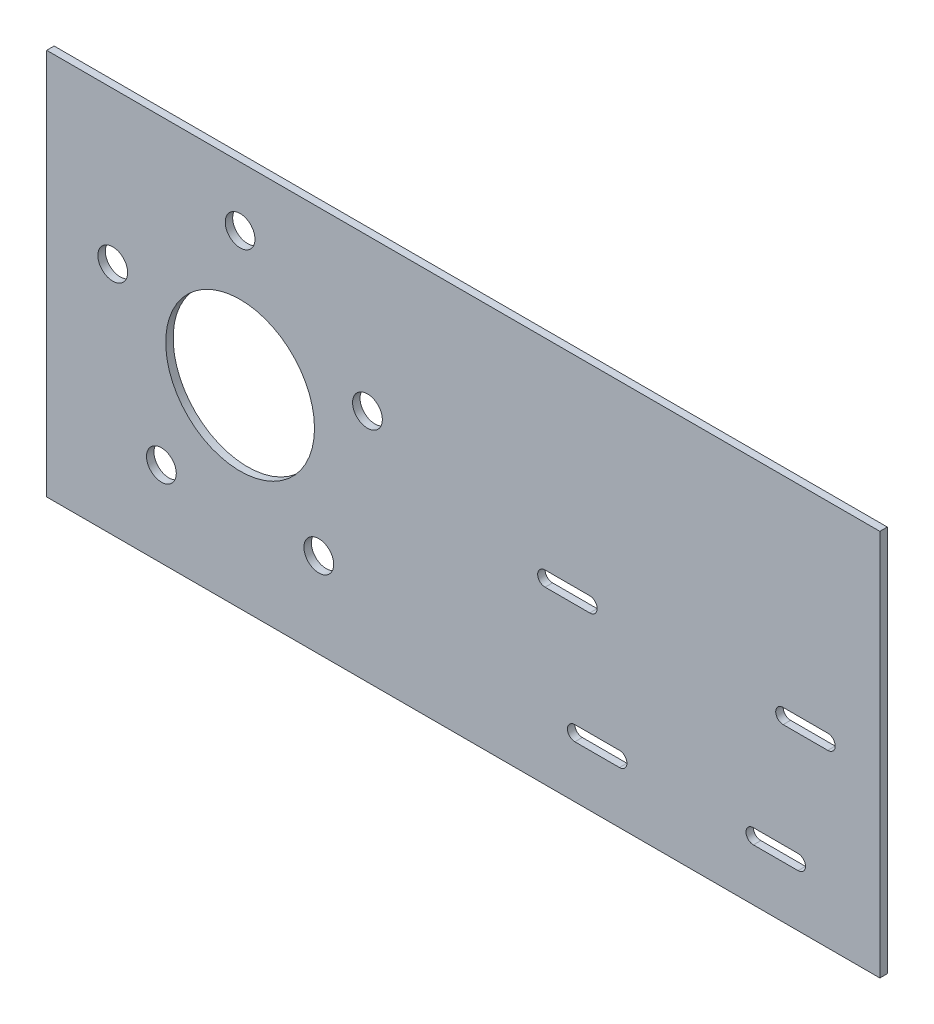
ISO-10303-21;
HEADER;
FILE_DESCRIPTION(('STEP AP214'),'2;1');
FILE_NAME('part.step','',(''),(''),'','','');
FILE_SCHEMA(('AUTOMOTIVE_DESIGN { 1 0 10303 214 1 1 1 1 }'));
ENDSEC;
DATA;
#1=APPLICATION_CONTEXT('core data for automotive mechanical design processes');
#2=APPLICATION_PROTOCOL_DEFINITION('international standard','automotive_design',2000,#1);
#3=PRODUCT_CONTEXT('',#1,'mechanical');
#4=PRODUCT('Part','Part','',(#3));
#5=PRODUCT_RELATED_PRODUCT_CATEGORY('part','',(#4));
#6=PRODUCT_DEFINITION_FORMATION('','',#4);
#7=PRODUCT_DEFINITION_CONTEXT('part definition',#1,'design');
#8=PRODUCT_DEFINITION('design','',#6,#7);
#9=PRODUCT_DEFINITION_SHAPE('','',#8);
#10=(LENGTH_UNIT() NAMED_UNIT(*) SI_UNIT(.MILLI.,.METRE.));
#11=(NAMED_UNIT(*) PLANE_ANGLE_UNIT() SI_UNIT($,.RADIAN.));
#12=(NAMED_UNIT(*) SI_UNIT($,.STERADIAN.) SOLID_ANGLE_UNIT());
#13=UNCERTAINTY_MEASURE_WITH_UNIT(LENGTH_MEASURE(1.E-05),#10,'distance_accuracy_value','');
#14=(GEOMETRIC_REPRESENTATION_CONTEXT(3) GLOBAL_UNCERTAINTY_ASSIGNED_CONTEXT((#13)) GLOBAL_UNIT_ASSIGNED_CONTEXT((#10,
#11,#12)) REPRESENTATION_CONTEXT('',''));
#15=CARTESIAN_POINT('',(0.,0.,0.));
#16=DIRECTION('',(0.,0.,1.));
#17=DIRECTION('',(1.,0.,0.));
#18=AXIS2_PLACEMENT_3D('',#15,#16,#17);
#19=CARTESIAN_POINT('',(-54.3528799062678,17.6603212285289,3.175));
#20=DIRECTION('',(0.,0.,-1.));
#21=DIRECTION('',(-0.309016994374958,-0.95105651629515,0.));
#22=AXIS2_PLACEMENT_3D('',#19,#20,#21);
#23=CYLINDRICAL_SURFACE('',#22,6.35);
#24=CARTESIAN_POINT('',(-54.3528799062678,17.6603212285289,3.175));
#25=DIRECTION('',(0.,0.,1.));
#26=DIRECTION('',(0.309016994374958,0.95105651629515,0.));
#27=AXIS2_PLACEMENT_3D('',#24,#25,#26);
#28=CIRCLE('',#27,6.35);
#29=CARTESIAN_POINT('',(-52.3906219919868,23.6995301070031,3.175));
#30=VERTEX_POINT('',#29);
#31=EDGE_CURVE('E44',#30,#30,#28,.T.);
#32=ORIENTED_EDGE('',*,*,#31,.T.);
#33=EDGE_LOOP('',(#32));
#34=FACE_BOUND('',#33,.T.);
#35=CARTESIAN_POINT('',(-54.3528799062678,17.6603212285289,0.));
#36=DIRECTION('',(0.,0.,1.));
#37=DIRECTION('',(0.309016994374958,0.95105651629515,0.));
#38=AXIS2_PLACEMENT_3D('',#35,#36,#37);
#39=CIRCLE('',#38,6.35);
#40=CARTESIAN_POINT('',(-52.3906219919868,23.6995301070031,0.));
#41=VERTEX_POINT('',#40);
#42=EDGE_CURVE('E11',#41,#41,#39,.T.);
#43=ORIENTED_EDGE('',*,*,#42,.F.);
#44=EDGE_LOOP('',(#43));
#45=FACE_BOUND('',#44,.T.);
#46=ADVANCED_FACE('F37',(#34,#45),#23,.F.);
#47=CARTESIAN_POINT('',(-33.5919271685152,-46.235321228528,3.175));
#48=DIRECTION('',(0.,0.,-1.));
#49=DIRECTION('',(0.809016994374942,-0.58778525229248,0.));
#50=AXIS2_PLACEMENT_3D('',#47,#48,#49);
#51=CYLINDRICAL_SURFACE('',#50,6.35);
#52=CARTESIAN_POINT('',(-33.5919271685152,-46.235321228528,3.175));
#53=DIRECTION('',(0.,0.,1.));
#54=DIRECTION('',(-0.809016994374942,0.58778525229248,0.));
#55=AXIS2_PLACEMENT_3D('',#52,#53,#54);
#56=CIRCLE('',#55,6.35);
#57=CARTESIAN_POINT('',(-38.7291850827961,-42.5028848764707,3.175));
#58=VERTEX_POINT('',#57);
#59=EDGE_CURVE('E361',#58,#58,#56,.T.);
#60=ORIENTED_EDGE('',*,*,#59,.T.);
#61=EDGE_LOOP('',(#60));
#62=FACE_BOUND('',#61,.T.);
#63=CARTESIAN_POINT('',(-33.5919271685152,-46.235321228528,0.));
#64=DIRECTION('',(0.,0.,1.));
#65=DIRECTION('',(-0.809016994374942,0.58778525229248,0.));
#66=AXIS2_PLACEMENT_3D('',#63,#64,#65);
#67=CIRCLE('',#66,6.35);
#68=CARTESIAN_POINT('',(-38.7291850827961,-42.5028848764707,0.));
#69=VERTEX_POINT('',#68);
#70=EDGE_CURVE('E364',#69,#69,#67,.T.);
#71=ORIENTED_EDGE('',*,*,#70,.F.);
#72=EDGE_LOOP('',(#71));
#73=FACE_BOUND('',#72,.T.);
#74=ADVANCED_FACE('F424',(#62,#73),#51,.F.);
#75=CARTESIAN_POINT('',(33.5919271685146,-46.2353212285284,3.175));
#76=DIRECTION('',(0.,0.,-1.));
#77=DIRECTION('',(0.809016994374951,0.587785252292469,0.));
#78=AXIS2_PLACEMENT_3D('',#75,#76,#77);
#79=CYLINDRICAL_SURFACE('',#78,6.35);
#80=CARTESIAN_POINT('',(33.5919271685146,-46.2353212285284,3.175));
#81=DIRECTION('',(0.,0.,1.));
#82=DIRECTION('',(-0.809016994374951,-0.587785252292469,0.));
#83=AXIS2_PLACEMENT_3D('',#80,#81,#82);
#84=CIRCLE('',#83,6.35);
#85=CARTESIAN_POINT('',(28.4546692542336,-49.9677575805856,3.175));
#86=VERTEX_POINT('',#85);
#87=EDGE_CURVE('E355',#86,#86,#84,.T.);
#88=ORIENTED_EDGE('',*,*,#87,.T.);
#89=EDGE_LOOP('',(#88));
#90=FACE_BOUND('',#89,.T.);
#91=CARTESIAN_POINT('',(33.5919271685146,-46.2353212285284,0.));
#92=DIRECTION('',(0.,0.,1.));
#93=DIRECTION('',(-0.809016994374951,-0.587785252292469,0.));
#94=AXIS2_PLACEMENT_3D('',#91,#92,#93);
#95=CIRCLE('',#94,6.35);
#96=CARTESIAN_POINT('',(28.4546692542336,-49.9677575805856,0.));
#97=VERTEX_POINT('',#96);
#98=EDGE_CURVE('E358',#97,#97,#95,.T.);
#99=ORIENTED_EDGE('',*,*,#98,.F.);
#100=EDGE_LOOP('',(#99));
#101=FACE_BOUND('',#100,.T.);
#102=ADVANCED_FACE('F428',(#90,#101),#79,.F.);
#103=CARTESIAN_POINT('',(54.3528799062681,17.6603212285281,3.175));
#104=DIRECTION('',(0.,0.,-1.));
#105=DIRECTION('',(-0.309016994374945,0.951056516295155,0.));
#106=AXIS2_PLACEMENT_3D('',#103,#104,#105);
#107=CYLINDRICAL_SURFACE('',#106,6.35);
#108=CARTESIAN_POINT('',(54.3528799062681,17.6603212285281,3.175));
#109=DIRECTION('',(0.,0.,1.));
#110=DIRECTION('',(0.309016994374945,-0.951056516295155,0.));
#111=AXIS2_PLACEMENT_3D('',#108,#109,#110);
#112=CIRCLE('',#111,6.35);
#113=CARTESIAN_POINT('',(56.315137820549,11.6211123500539,3.175));
#114=VERTEX_POINT('',#113);
#115=EDGE_CURVE('E349',#114,#114,#112,.T.);
#116=ORIENTED_EDGE('',*,*,#115,.T.);
#117=EDGE_LOOP('',(#116));
#118=FACE_BOUND('',#117,.T.);
#119=CARTESIAN_POINT('',(54.3528799062681,17.6603212285281,0.));
#120=DIRECTION('',(0.,0.,1.));
#121=DIRECTION('',(0.309016994374945,-0.951056516295155,0.));
#122=AXIS2_PLACEMENT_3D('',#119,#120,#121);
#123=CIRCLE('',#122,6.35);
#124=CARTESIAN_POINT('',(56.315137820549,11.6211123500539,0.));
#125=VERTEX_POINT('',#124);
#126=EDGE_CURVE('E352',#125,#125,#123,.T.);
#127=ORIENTED_EDGE('',*,*,#126,.F.);
#128=EDGE_LOOP('',(#127));
#129=FACE_BOUND('',#128,.T.);
#130=ADVANCED_FACE('F374',(#118,#129),#107,.F.);
#131=CARTESIAN_POINT('',(-82.55,82.5499999999999,3.175));
#132=DIRECTION('',(0.,0.,1.));
#133=DIRECTION('',(1.,0.,0.));
#134=AXIS2_PLACEMENT_3D('',#131,#132,#133);
#135=PLANE('',#134);
#136=ORIENTED_EDGE('',*,*,#31,.F.);
#137=EDGE_LOOP('',(#136));
#138=FACE_BOUND('',#137,.T.);
#139=ORIENTED_EDGE('',*,*,#59,.F.);
#140=EDGE_LOOP('',(#139));
#141=FACE_BOUND('',#140,.T.);
#142=ORIENTED_EDGE('',*,*,#87,.F.);
#143=EDGE_LOOP('',(#142));
#144=FACE_BOUND('',#143,.T.);
#145=ORIENTED_EDGE('',*,*,#115,.F.);
#146=EDGE_LOOP('',(#145));
#147=FACE_BOUND('',#146,.T.);
#148=CARTESIAN_POINT('',(142.875,-57.15,3.175));
#149=DIRECTION('',(0.,0.,1.));
#150=DIRECTION('',(1.,0.,0.));
#151=AXIS2_PLACEMENT_3D('',#148,#149,#150);
#152=CIRCLE('',#151,3.17500000000001);
#153=CARTESIAN_POINT('',(142.875,-53.975,3.175));
#154=VERTEX_POINT('',#153);
#155=CARTESIAN_POINT('',(142.875,-60.325,3.175));
#156=VERTEX_POINT('',#155);
#157=EDGE_CURVE('E51',#154,#156,#152,.T.);
#158=ORIENTED_EDGE('',*,*,#157,.F.);
#159=DIRECTION('',(-1.,0.,0.));
#160=VECTOR('',#159,1.);
#161=CARTESIAN_POINT('',(142.875,-53.975,3.175));
#162=LINE('',#161,#160);
#163=CARTESIAN_POINT('',(161.925,-53.9749999999999,3.175));
#164=VERTEX_POINT('',#163);
#165=EDGE_CURVE('E191',#164,#154,#162,.T.);
#166=ORIENTED_EDGE('',*,*,#165,.F.);
#167=CARTESIAN_POINT('',(161.925,-57.15,3.175));
#168=DIRECTION('',(0.,0.,1.));
#169=DIRECTION('',(1.,0.,0.));
#170=AXIS2_PLACEMENT_3D('',#167,#168,#169);
#171=CIRCLE('',#170,3.17500000000001);
#172=CARTESIAN_POINT('',(161.925,-60.325,3.175));
#173=VERTEX_POINT('',#172);
#174=EDGE_CURVE('E194',#173,#164,#171,.T.);
#175=ORIENTED_EDGE('',*,*,#174,.F.);
#176=DIRECTION('',(1.,0.,0.));
#177=VECTOR('',#176,1.);
#178=CARTESIAN_POINT('',(142.875,-60.325,3.175));
#179=LINE('',#178,#177);
#180=EDGE_CURVE('E200',#156,#173,#179,.T.);
#181=ORIENTED_EDGE('',*,*,#180,.F.);
#182=EDGE_LOOP('',(#158,#166,#175,#181));
#183=FACE_BOUND('',#182,.T.);
#184=CARTESIAN_POINT('',(238.125,-57.15,3.175));
#185=DIRECTION('',(0.,0.,1.));
#186=DIRECTION('',(1.,0.,0.));
#187=AXIS2_PLACEMENT_3D('',#184,#185,#186);
#188=CIRCLE('',#187,3.17499999999999);
#189=CARTESIAN_POINT('',(238.125,-60.3249999999999,3.175));
#190=VERTEX_POINT('',#189);
#191=CARTESIAN_POINT('',(238.125,-53.975,3.175));
#192=VERTEX_POINT('',#191);
#193=EDGE_CURVE('E206',#190,#192,#188,.T.);
#194=ORIENTED_EDGE('',*,*,#193,.F.);
#195=DIRECTION('',(1.,0.,0.));
#196=VECTOR('',#195,1.);
#197=CARTESIAN_POINT('',(238.125,-60.3249999999999,3.175));
#198=LINE('',#197,#196);
#199=CARTESIAN_POINT('',(219.075,-60.325,3.175));
#200=VERTEX_POINT('',#199);
#201=EDGE_CURVE('E214',#200,#190,#198,.T.);
#202=ORIENTED_EDGE('',*,*,#201,.F.);
#203=CARTESIAN_POINT('',(219.075,-57.15,3.175));
#204=DIRECTION('',(0.,0.,1.));
#205=DIRECTION('',(1.,0.,0.));
#206=AXIS2_PLACEMENT_3D('',#203,#204,#205);
#207=CIRCLE('',#206,3.17499999999999);
#208=CARTESIAN_POINT('',(219.075,-53.975,3.175));
#209=VERTEX_POINT('',#208);
#210=EDGE_CURVE('E228',#209,#200,#207,.T.);
#211=ORIENTED_EDGE('',*,*,#210,.F.);
#212=DIRECTION('',(-1.,0.,0.));
#213=VECTOR('',#212,1.);
#214=CARTESIAN_POINT('',(238.125,-53.975,3.175));
#215=LINE('',#214,#213);
#216=EDGE_CURVE('E225',#192,#209,#215,.T.);
#217=ORIENTED_EDGE('',*,*,#216,.F.);
#218=EDGE_LOOP('',(#194,#202,#211,#217));
#219=FACE_BOUND('',#218,.T.);
#220=CARTESIAN_POINT('',(250.825,-6.34999999999996,3.175));
#221=DIRECTION('',(0.,0.,1.));
#222=DIRECTION('',(1.,0.,0.));
#223=AXIS2_PLACEMENT_3D('',#220,#221,#222);
#224=CIRCLE('',#223,3.175);
#225=CARTESIAN_POINT('',(250.825,-9.52499999999996,3.175));
#226=VERTEX_POINT('',#225);
#227=CARTESIAN_POINT('',(250.825,-3.17499999999997,3.175));
#228=VERTEX_POINT('',#227);
#229=EDGE_CURVE('E235',#226,#228,#224,.T.);
#230=ORIENTED_EDGE('',*,*,#229,.F.);
#231=DIRECTION('',(1.,0.,0.));
#232=VECTOR('',#231,1.);
#233=CARTESIAN_POINT('',(250.825,-9.52499999999996,3.175));
#234=LINE('',#233,#232);
#235=CARTESIAN_POINT('',(231.775,-9.52499999999997,3.175));
#236=VERTEX_POINT('',#235);
#237=EDGE_CURVE('E246',#236,#226,#234,.T.);
#238=ORIENTED_EDGE('',*,*,#237,.F.);
#239=CARTESIAN_POINT('',(231.775,-6.34999999999997,3.175));
#240=DIRECTION('',(0.,0.,1.));
#241=DIRECTION('',(1.,0.,0.));
#242=AXIS2_PLACEMENT_3D('',#239,#240,#241);
#243=CIRCLE('',#242,3.175);
#244=CARTESIAN_POINT('',(231.775,-3.17499999999997,3.175));
#245=VERTEX_POINT('',#244);
#246=EDGE_CURVE('E260',#245,#236,#243,.T.);
#247=ORIENTED_EDGE('',*,*,#246,.F.);
#248=DIRECTION('',(-1.,0.,0.));
#249=VECTOR('',#248,1.);
#250=CARTESIAN_POINT('',(250.825,-3.17499999999996,3.175));
#251=LINE('',#250,#249);
#252=EDGE_CURVE('E257',#228,#245,#251,.T.);
#253=ORIENTED_EDGE('',*,*,#252,.F.);
#254=EDGE_LOOP('',(#230,#238,#247,#253));
#255=FACE_BOUND('',#254,.T.);
#256=CARTESIAN_POINT('',(149.225,-6.34999999999996,3.175));
#257=DIRECTION('',(0.,0.,1.));
#258=DIRECTION('',(1.,0.,0.));
#259=AXIS2_PLACEMENT_3D('',#256,#257,#258);
#260=CIRCLE('',#259,3.175);
#261=CARTESIAN_POINT('',(149.225,-9.52499999999997,3.175));
#262=VERTEX_POINT('',#261);
#263=CARTESIAN_POINT('',(149.225,-3.17499999999995,3.175));
#264=VERTEX_POINT('',#263);
#265=EDGE_CURVE('E267',#262,#264,#260,.T.);
#266=ORIENTED_EDGE('',*,*,#265,.F.);
#267=DIRECTION('',(1.,0.,0.));
#268=VECTOR('',#267,1.);
#269=CARTESIAN_POINT('',(149.225,-9.52499999999997,3.175));
#270=LINE('',#269,#268);
#271=CARTESIAN_POINT('',(130.175,-9.52499999999997,3.175));
#272=VERTEX_POINT('',#271);
#273=EDGE_CURVE('E278',#272,#262,#270,.T.);
#274=ORIENTED_EDGE('',*,*,#273,.F.);
#275=CARTESIAN_POINT('',(130.175,-6.34999999999997,3.175));
#276=DIRECTION('',(0.,0.,1.));
#277=DIRECTION('',(1.,0.,0.));
#278=AXIS2_PLACEMENT_3D('',#275,#276,#277);
#279=CIRCLE('',#278,3.175);
#280=CARTESIAN_POINT('',(130.175,-3.17499999999997,3.175));
#281=VERTEX_POINT('',#280);
#282=EDGE_CURVE('E292',#281,#272,#279,.T.);
#283=ORIENTED_EDGE('',*,*,#282,.F.);
#284=DIRECTION('',(-1.,0.,0.));
#285=VECTOR('',#284,1.);
#286=CARTESIAN_POINT('',(149.225,-3.17499999999996,3.175));
#287=LINE('',#286,#285);
#288=EDGE_CURVE('E289',#264,#281,#287,.T.);
#289=ORIENTED_EDGE('',*,*,#288,.F.);
#290=EDGE_LOOP('',(#266,#274,#283,#289));
#291=FACE_BOUND('',#290,.T.);
#292=CARTESIAN_POINT('',(0.,0.,3.175));
#293=DIRECTION('',(0.,0.,1.));
#294=DIRECTION('',(1.,0.,0.));
#295=AXIS2_PLACEMENT_3D('',#292,#293,#294);
#296=CIRCLE('',#295,31.75);
#297=CARTESIAN_POINT('',(31.75,0.,3.175));
#298=VERTEX_POINT('',#297);
#299=EDGE_CURVE('E312',#298,#298,#296,.T.);
#300=ORIENTED_EDGE('',*,*,#299,.F.);
#301=EDGE_LOOP('',(#300));
#302=FACE_BOUND('',#301,.T.);
#303=DIRECTION('',(0.,-1.,0.));
#304=VECTOR('',#303,1.);
#305=CARTESIAN_POINT('',(-82.55,-82.5500000000001,3.175));
#306=LINE('',#305,#304);
#307=CARTESIAN_POINT('',(-82.55,82.5499999999999,3.175));
#308=VERTEX_POINT('',#307);
#309=CARTESIAN_POINT('',(-82.55,-82.5500000000001,3.175));
#310=VERTEX_POINT('',#309);
#311=EDGE_CURVE('E320',#308,#310,#306,.T.);
#312=ORIENTED_EDGE('',*,*,#311,.T.);
#313=DIRECTION('',(1.,0.,0.));
#314=VECTOR('',#313,1.);
#315=CARTESIAN_POINT('',(273.05,-82.5499999999999,3.175));
#316=LINE('',#315,#314);
#317=CARTESIAN_POINT('',(273.05,-82.5499999999999,3.175));
#318=VERTEX_POINT('',#317);
#319=EDGE_CURVE('E323',#310,#318,#316,.T.);
#320=ORIENTED_EDGE('',*,*,#319,.T.);
#321=DIRECTION('',(0.,1.,0.));
#322=VECTOR('',#321,1.);
#323=CARTESIAN_POINT('',(273.05,-82.5499999999999,3.175));
#324=LINE('',#323,#322);
#325=CARTESIAN_POINT('',(273.05,82.5500000000001,3.175));
#326=VERTEX_POINT('',#325);
#327=EDGE_CURVE('E326',#318,#326,#324,.T.);
#328=ORIENTED_EDGE('',*,*,#327,.T.);
#329=DIRECTION('',(-1.,0.,0.));
#330=VECTOR('',#329,1.);
#331=CARTESIAN_POINT('',(273.05,82.5500000000001,3.175));
#332=LINE('',#331,#330);
#333=EDGE_CURVE('E328',#326,#308,#332,.T.);
#334=ORIENTED_EDGE('',*,*,#333,.T.);
#335=EDGE_LOOP('',(#312,#320,#328,#334));
#336=FACE_BOUND('',#335,.T.);
#337=CARTESIAN_POINT('',(0.,57.15,3.175));
#338=DIRECTION('',(0.,0.,1.));
#339=DIRECTION('',(1.,0.,0.));
#340=AXIS2_PLACEMENT_3D('',#337,#338,#339);
#341=CIRCLE('',#340,6.35);
#342=CARTESIAN_POINT('',(6.35,57.15,3.175));
#343=VERTEX_POINT('',#342);
#344=EDGE_CURVE('E306',#343,#343,#341,.T.);
#345=ORIENTED_EDGE('',*,*,#344,.F.);
#346=EDGE_LOOP('',(#345));
#347=FACE_BOUND('',#346,.T.);
#348=ADVANCED_FACE('F371',(#138,#141,#144,#147,#183,#219,#255,#291,#302,#336,#347),#135,.T.);
#349=CARTESIAN_POINT('',(-82.55,82.5499999999999,0.));
#350=DIRECTION('',(0.,0.,1.));
#351=DIRECTION('',(1.,0.,0.));
#352=AXIS2_PLACEMENT_3D('',#349,#350,#351);
#353=PLANE('',#352);
#354=ORIENTED_EDGE('',*,*,#42,.T.);
#355=EDGE_LOOP('',(#354));
#356=FACE_BOUND('',#355,.T.);
#357=ORIENTED_EDGE('',*,*,#70,.T.);
#358=EDGE_LOOP('',(#357));
#359=FACE_BOUND('',#358,.T.);
#360=ORIENTED_EDGE('',*,*,#98,.T.);
#361=EDGE_LOOP('',(#360));
#362=FACE_BOUND('',#361,.T.);
#363=ORIENTED_EDGE('',*,*,#126,.T.);
#364=EDGE_LOOP('',(#363));
#365=FACE_BOUND('',#364,.T.);
#366=DIRECTION('',(-1.,0.,0.));
#367=VECTOR('',#366,1.);
#368=CARTESIAN_POINT('',(142.875,-53.975,0.));
#369=LINE('',#368,#367);
#370=CARTESIAN_POINT('',(161.925,-53.9749999999999,0.));
#371=VERTEX_POINT('',#370);
#372=CARTESIAN_POINT('',(142.875,-53.975,0.));
#373=VERTEX_POINT('',#372);
#374=EDGE_CURVE('E181',#371,#373,#369,.T.);
#375=ORIENTED_EDGE('',*,*,#374,.T.);
#376=CARTESIAN_POINT('',(142.875,-57.15,0.));
#377=DIRECTION('',(0.,0.,1.));
#378=DIRECTION('',(1.,0.,0.));
#379=AXIS2_PLACEMENT_3D('',#376,#377,#378);
#380=CIRCLE('',#379,3.17500000000001);
#381=CARTESIAN_POINT('',(142.875,-60.325,0.));
#382=VERTEX_POINT('',#381);
#383=EDGE_CURVE('E175',#373,#382,#380,.T.);
#384=ORIENTED_EDGE('',*,*,#383,.T.);
#385=DIRECTION('',(1.,0.,0.));
#386=VECTOR('',#385,1.);
#387=CARTESIAN_POINT('',(142.875,-60.325,0.));
#388=LINE('',#387,#386);
#389=CARTESIAN_POINT('',(161.925,-60.325,0.));
#390=VERTEX_POINT('',#389);
#391=EDGE_CURVE('E184',#382,#390,#388,.T.);
#392=ORIENTED_EDGE('',*,*,#391,.T.);
#393=CARTESIAN_POINT('',(161.925,-57.15,0.));
#394=DIRECTION('',(0.,0.,1.));
#395=DIRECTION('',(1.,0.,0.));
#396=AXIS2_PLACEMENT_3D('',#393,#394,#395);
#397=CIRCLE('',#396,3.17500000000001);
#398=EDGE_CURVE('E59',#390,#371,#397,.T.);
#399=ORIENTED_EDGE('',*,*,#398,.T.);
#400=EDGE_LOOP('',(#375,#384,#392,#399));
#401=FACE_BOUND('',#400,.T.);
#402=DIRECTION('',(1.,0.,0.));
#403=VECTOR('',#402,1.);
#404=CARTESIAN_POINT('',(238.125,-60.3249999999999,0.));
#405=LINE('',#404,#403);
#406=CARTESIAN_POINT('',(219.075,-60.325,0.));
#407=VERTEX_POINT('',#406);
#408=CARTESIAN_POINT('',(238.125,-60.3249999999999,0.));
#409=VERTEX_POINT('',#408);
#410=EDGE_CURVE('E220',#407,#409,#405,.T.);
#411=ORIENTED_EDGE('',*,*,#410,.T.);
#412=CARTESIAN_POINT('',(238.125,-57.15,0.));
#413=DIRECTION('',(0.,0.,1.));
#414=DIRECTION('',(1.,0.,0.));
#415=AXIS2_PLACEMENT_3D('',#412,#413,#414);
#416=CIRCLE('',#415,3.17499999999999);
#417=CARTESIAN_POINT('',(238.125,-53.975,0.));
#418=VERTEX_POINT('',#417);
#419=EDGE_CURVE('E210',#409,#418,#416,.T.);
#420=ORIENTED_EDGE('',*,*,#419,.T.);
#421=DIRECTION('',(-1.,0.,0.));
#422=VECTOR('',#421,1.);
#423=CARTESIAN_POINT('',(238.125,-53.975,0.));
#424=LINE('',#423,#422);
#425=CARTESIAN_POINT('',(219.075,-53.975,0.));
#426=VERTEX_POINT('',#425);
#427=EDGE_CURVE('E213',#418,#426,#424,.T.);
#428=ORIENTED_EDGE('',*,*,#427,.T.);
#429=CARTESIAN_POINT('',(219.075,-57.15,0.));
#430=DIRECTION('',(0.,0.,1.));
#431=DIRECTION('',(1.,0.,0.));
#432=AXIS2_PLACEMENT_3D('',#429,#430,#431);
#433=CIRCLE('',#432,3.17499999999999);
#434=EDGE_CURVE('E217',#426,#407,#433,.T.);
#435=ORIENTED_EDGE('',*,*,#434,.T.);
#436=EDGE_LOOP('',(#411,#420,#428,#435));
#437=FACE_BOUND('',#436,.T.);
#438=DIRECTION('',(1.,0.,0.));
#439=VECTOR('',#438,1.);
#440=CARTESIAN_POINT('',(250.825,-9.52499999999996,0.));
#441=LINE('',#440,#439);
#442=CARTESIAN_POINT('',(231.775,-9.52499999999997,0.));
#443=VERTEX_POINT('',#442);
#444=CARTESIAN_POINT('',(250.825,-9.52499999999996,0.));
#445=VERTEX_POINT('',#444);
#446=EDGE_CURVE('E252',#443,#445,#441,.T.);
#447=ORIENTED_EDGE('',*,*,#446,.T.);
#448=CARTESIAN_POINT('',(250.825,-6.34999999999996,0.));
#449=DIRECTION('',(0.,0.,1.));
#450=DIRECTION('',(1.,0.,0.));
#451=AXIS2_PLACEMENT_3D('',#448,#449,#450);
#452=CIRCLE('',#451,3.175);
#453=CARTESIAN_POINT('',(250.825,-3.17499999999996,0.));
#454=VERTEX_POINT('',#453);
#455=EDGE_CURVE('E242',#445,#454,#452,.T.);
#456=ORIENTED_EDGE('',*,*,#455,.T.);
#457=DIRECTION('',(-1.,0.,0.));
#458=VECTOR('',#457,1.);
#459=CARTESIAN_POINT('',(250.825,-3.17499999999996,0.));
#460=LINE('',#459,#458);
#461=CARTESIAN_POINT('',(231.775,-3.17499999999998,0.));
#462=VERTEX_POINT('',#461);
#463=EDGE_CURVE('E245',#454,#462,#460,.T.);
#464=ORIENTED_EDGE('',*,*,#463,.T.);
#465=CARTESIAN_POINT('',(231.775,-6.34999999999997,0.));
#466=DIRECTION('',(0.,0.,1.));
#467=DIRECTION('',(1.,0.,0.));
#468=AXIS2_PLACEMENT_3D('',#465,#466,#467);
#469=CIRCLE('',#468,3.175);
#470=EDGE_CURVE('E249',#462,#443,#469,.T.);
#471=ORIENTED_EDGE('',*,*,#470,.T.);
#472=EDGE_LOOP('',(#447,#456,#464,#471));
#473=FACE_BOUND('',#472,.T.);
#474=DIRECTION('',(1.,0.,0.));
#475=VECTOR('',#474,1.);
#476=CARTESIAN_POINT('',(149.225,-9.52499999999997,0.));
#477=LINE('',#476,#475);
#478=CARTESIAN_POINT('',(130.175,-9.52499999999997,0.));
#479=VERTEX_POINT('',#478);
#480=CARTESIAN_POINT('',(149.225,-9.52499999999997,0.));
#481=VERTEX_POINT('',#480);
#482=EDGE_CURVE('E284',#479,#481,#477,.T.);
#483=ORIENTED_EDGE('',*,*,#482,.T.);
#484=CARTESIAN_POINT('',(149.225,-6.34999999999996,0.));
#485=DIRECTION('',(0.,0.,1.));
#486=DIRECTION('',(1.,0.,0.));
#487=AXIS2_PLACEMENT_3D('',#484,#485,#486);
#488=CIRCLE('',#487,3.175);
#489=CARTESIAN_POINT('',(149.225,-3.17499999999996,0.));
#490=VERTEX_POINT('',#489);
#491=EDGE_CURVE('E274',#481,#490,#488,.T.);
#492=ORIENTED_EDGE('',*,*,#491,.T.);
#493=DIRECTION('',(-1.,0.,0.));
#494=VECTOR('',#493,1.);
#495=CARTESIAN_POINT('',(149.225,-3.17499999999996,0.));
#496=LINE('',#495,#494);
#497=CARTESIAN_POINT('',(130.175,-3.17499999999996,0.));
#498=VERTEX_POINT('',#497);
#499=EDGE_CURVE('E277',#490,#498,#496,.T.);
#500=ORIENTED_EDGE('',*,*,#499,.T.);
#501=CARTESIAN_POINT('',(130.175,-6.34999999999997,0.));
#502=DIRECTION('',(0.,0.,1.));
#503=DIRECTION('',(1.,0.,0.));
#504=AXIS2_PLACEMENT_3D('',#501,#502,#503);
#505=CIRCLE('',#504,3.175);
#506=EDGE_CURVE('E281',#498,#479,#505,.T.);
#507=ORIENTED_EDGE('',*,*,#506,.T.);
#508=EDGE_LOOP('',(#483,#492,#500,#507));
#509=FACE_BOUND('',#508,.T.);
#510=CARTESIAN_POINT('',(0.,0.,0.));
#511=DIRECTION('',(0.,0.,1.));
#512=DIRECTION('',(1.,0.,0.));
#513=AXIS2_PLACEMENT_3D('',#510,#511,#512);
#514=CIRCLE('',#513,31.75);
#515=CARTESIAN_POINT('',(31.75,0.,0.));
#516=VERTEX_POINT('',#515);
#517=EDGE_CURVE('E309',#516,#516,#514,.T.);
#518=ORIENTED_EDGE('',*,*,#517,.T.);
#519=EDGE_LOOP('',(#518));
#520=FACE_BOUND('',#519,.T.);
#521=DIRECTION('',(0.,-1.,0.));
#522=VECTOR('',#521,1.);
#523=CARTESIAN_POINT('',(-82.55,-82.5500000000001,0.));
#524=LINE('',#523,#522);
#525=CARTESIAN_POINT('',(-82.55,82.5499999999999,0.));
#526=VERTEX_POINT('',#525);
#527=CARTESIAN_POINT('',(-82.55,-82.5500000000001,0.));
#528=VERTEX_POINT('',#527);
#529=EDGE_CURVE('E316',#526,#528,#524,.T.);
#530=ORIENTED_EDGE('',*,*,#529,.F.);
#531=DIRECTION('',(-1.,0.,0.));
#532=VECTOR('',#531,1.);
#533=CARTESIAN_POINT('',(273.05,82.5500000000001,0.));
#534=LINE('',#533,#532);
#535=CARTESIAN_POINT('',(273.05,82.5500000000001,0.));
#536=VERTEX_POINT('',#535);
#537=EDGE_CURVE('E324',#536,#526,#534,.T.);
#538=ORIENTED_EDGE('',*,*,#537,.F.);
#539=DIRECTION('',(0.,1.,0.));
#540=VECTOR('',#539,1.);
#541=CARTESIAN_POINT('',(273.05,-82.5499999999999,0.));
#542=LINE('',#541,#540);
#543=CARTESIAN_POINT('',(273.05,-82.5499999999999,0.));
#544=VERTEX_POINT('',#543);
#545=EDGE_CURVE('E335',#544,#536,#542,.T.);
#546=ORIENTED_EDGE('',*,*,#545,.F.);
#547=DIRECTION('',(1.,0.,0.));
#548=VECTOR('',#547,1.);
#549=CARTESIAN_POINT('',(273.05,-82.5499999999999,0.));
#550=LINE('',#549,#548);
#551=EDGE_CURVE('E333',#528,#544,#550,.T.);
#552=ORIENTED_EDGE('',*,*,#551,.F.);
#553=EDGE_LOOP('',(#530,#538,#546,#552));
#554=FACE_BOUND('',#553,.T.);
#555=CARTESIAN_POINT('',(0.,57.15,0.));
#556=DIRECTION('',(0.,0.,1.));
#557=DIRECTION('',(1.,0.,0.));
#558=AXIS2_PLACEMENT_3D('',#555,#556,#557);
#559=CIRCLE('',#558,6.35);
#560=CARTESIAN_POINT('',(6.35,57.15,0.));
#561=VERTEX_POINT('',#560);
#562=EDGE_CURVE('E299',#561,#561,#559,.T.);
#563=ORIENTED_EDGE('',*,*,#562,.T.);
#564=EDGE_LOOP('',(#563));
#565=FACE_BOUND('',#564,.T.);
#566=ADVANCED_FACE('F188',(#356,#359,#362,#365,#401,#437,#473,#509,#520,#554,#565),#353,.F.);
#567=CARTESIAN_POINT('',(-82.55,-82.5500000000001,3.175));
#568=DIRECTION('',(1.,0.,0.));
#569=DIRECTION('',(0.,1.,0.));
#570=AXIS2_PLACEMENT_3D('',#567,#568,#569);
#571=PLANE('',#570);
#572=ORIENTED_EDGE('',*,*,#529,.T.);
#573=DIRECTION('',(0.,0.,-1.));
#574=VECTOR('',#573,1.);
#575=CARTESIAN_POINT('',(-82.55,-82.5500000000001,3.175));
#576=LINE('',#575,#574);
#577=EDGE_CURVE('E346',#310,#528,#576,.T.);
#578=ORIENTED_EDGE('',*,*,#577,.F.);
#579=ORIENTED_EDGE('',*,*,#311,.F.);
#580=DIRECTION('',(0.,0.,-1.));
#581=VECTOR('',#580,1.);
#582=CARTESIAN_POINT('',(-82.55,82.5499999999999,3.175));
#583=LINE('',#582,#581);
#584=EDGE_CURVE('E330',#308,#526,#583,.T.);
#585=ORIENTED_EDGE('',*,*,#584,.T.);
#586=EDGE_LOOP('',(#572,#578,#579,#585));
#587=FACE_BOUND('',#586,.T.);
#588=ADVANCED_FACE('F412',(#587),#571,.F.);
#589=CARTESIAN_POINT('',(273.05,-82.5499999999999,3.175));
#590=DIRECTION('',(0.,1.,0.));
#591=DIRECTION('',(-1.,0.,0.));
#592=AXIS2_PLACEMENT_3D('',#589,#590,#591);
#593=PLANE('',#592);
#594=ORIENTED_EDGE('',*,*,#551,.T.);
#595=DIRECTION('',(0.,0.,-1.));
#596=VECTOR('',#595,1.);
#597=CARTESIAN_POINT('',(273.05,-82.5499999999999,3.175));
#598=LINE('',#597,#596);
#599=EDGE_CURVE('E343',#318,#544,#598,.T.);
#600=ORIENTED_EDGE('',*,*,#599,.F.);
#601=ORIENTED_EDGE('',*,*,#319,.F.);
#602=ORIENTED_EDGE('',*,*,#577,.T.);
#603=EDGE_LOOP('',(#594,#600,#601,#602));
#604=FACE_BOUND('',#603,.T.);
#605=ADVANCED_FACE('F418',(#604),#593,.F.);
#606=CARTESIAN_POINT('',(273.05,-82.5499999999999,3.175));
#607=DIRECTION('',(-1.,0.,0.));
#608=DIRECTION('',(0.,0.,1.));
#609=AXIS2_PLACEMENT_3D('',#606,#607,#608);
#610=PLANE('',#609);
#611=ORIENTED_EDGE('',*,*,#545,.T.);
#612=DIRECTION('',(0.,0.,-1.));
#613=VECTOR('',#612,1.);
#614=CARTESIAN_POINT('',(273.05,82.5500000000001,3.175));
#615=LINE('',#614,#613);
#616=EDGE_CURVE('E340',#326,#536,#615,.T.);
#617=ORIENTED_EDGE('',*,*,#616,.F.);
#618=ORIENTED_EDGE('',*,*,#327,.F.);
#619=ORIENTED_EDGE('',*,*,#599,.T.);
#620=EDGE_LOOP('',(#611,#617,#618,#619));
#621=FACE_BOUND('',#620,.T.);
#622=ADVANCED_FACE('F442',(#621),#610,.F.);
#623=CARTESIAN_POINT('',(273.05,82.5500000000001,3.175));
#624=DIRECTION('',(0.,-1.,0.));
#625=DIRECTION('',(1.,0.,0.));
#626=AXIS2_PLACEMENT_3D('',#623,#624,#625);
#627=PLANE('',#626);
#628=ORIENTED_EDGE('',*,*,#537,.T.);
#629=ORIENTED_EDGE('',*,*,#584,.F.);
#630=ORIENTED_EDGE('',*,*,#333,.F.);
#631=ORIENTED_EDGE('',*,*,#616,.T.);
#632=EDGE_LOOP('',(#628,#629,#630,#631));
#633=FACE_BOUND('',#632,.T.);
#634=ADVANCED_FACE('F445',(#633),#627,.F.);
#635=CARTESIAN_POINT('',(0.,0.,3.175));
#636=DIRECTION('',(0.,0.,-1.));
#637=DIRECTION('',(-1.,0.,0.));
#638=AXIS2_PLACEMENT_3D('',#635,#636,#637);
#639=CYLINDRICAL_SURFACE('',#638,31.75);
#640=ORIENTED_EDGE('',*,*,#299,.T.);
#641=EDGE_LOOP('',(#640));
#642=FACE_BOUND('',#641,.T.);
#643=ORIENTED_EDGE('',*,*,#517,.F.);
#644=EDGE_LOOP('',(#643));
#645=FACE_BOUND('',#644,.T.);
#646=ADVANCED_FACE('F407',(#642,#645),#639,.F.);
#647=CARTESIAN_POINT('',(0.,57.15,3.175));
#648=DIRECTION('',(0.,0.,-1.));
#649=DIRECTION('',(-1.,0.,0.));
#650=AXIS2_PLACEMENT_3D('',#647,#648,#649);
#651=CYLINDRICAL_SURFACE('',#650,6.35);
#652=ORIENTED_EDGE('',*,*,#344,.T.);
#653=EDGE_LOOP('',(#652));
#654=FACE_BOUND('',#653,.T.);
#655=ORIENTED_EDGE('',*,*,#562,.F.);
#656=EDGE_LOOP('',(#655));
#657=FACE_BOUND('',#656,.T.);
#658=ADVANCED_FACE('F403',(#654,#657),#651,.F.);
#659=CARTESIAN_POINT('',(149.225,-6.34999999999996,0.));
#660=DIRECTION('',(0.,0.,1.));
#661=DIRECTION('',(1.,0.,0.));
#662=AXIS2_PLACEMENT_3D('',#659,#660,#661);
#663=CYLINDRICAL_SURFACE('',#662,3.175);
#664=ORIENTED_EDGE('',*,*,#265,.T.);
#665=DIRECTION('',(0.,0.,1.));
#666=VECTOR('',#665,1.);
#667=CARTESIAN_POINT('',(149.225,-3.17499999999996,0.));
#668=LINE('',#667,#666);
#669=EDGE_CURVE('E287',#490,#264,#668,.T.);
#670=ORIENTED_EDGE('',*,*,#669,.F.);
#671=ORIENTED_EDGE('',*,*,#491,.F.);
#672=DIRECTION('',(0.,0.,1.));
#673=VECTOR('',#672,1.);
#674=CARTESIAN_POINT('',(149.225,-9.52499999999997,0.));
#675=LINE('',#674,#673);
#676=EDGE_CURVE('E297',#481,#262,#675,.T.);
#677=ORIENTED_EDGE('',*,*,#676,.T.);
#678=EDGE_LOOP('',(#664,#670,#671,#677));
#679=FACE_BOUND('',#678,.T.);
#680=ADVANCED_FACE('F406',(#679),#663,.F.);
#681=CARTESIAN_POINT('',(149.225,-9.52499999999997,0.));
#682=DIRECTION('',(0.,-1.,0.));
#683=DIRECTION('',(1.,0.,0.));
#684=AXIS2_PLACEMENT_3D('',#681,#682,#683);
#685=PLANE('',#684);
#686=ORIENTED_EDGE('',*,*,#273,.T.);
#687=ORIENTED_EDGE('',*,*,#676,.F.);
#688=ORIENTED_EDGE('',*,*,#482,.F.);
#689=DIRECTION('',(0.,0.,1.));
#690=VECTOR('',#689,1.);
#691=CARTESIAN_POINT('',(130.175,-9.52499999999997,0.));
#692=LINE('',#691,#690);
#693=EDGE_CURVE('E300',#479,#272,#692,.T.);
#694=ORIENTED_EDGE('',*,*,#693,.T.);
#695=EDGE_LOOP('',(#686,#687,#688,#694));
#696=FACE_BOUND('',#695,.T.);
#697=ADVANCED_FACE('F469',(#696),#685,.F.);
#698=CARTESIAN_POINT('',(130.175,-6.34999999999997,0.));
#699=DIRECTION('',(0.,0.,1.));
#700=DIRECTION('',(1.,0.,0.));
#701=AXIS2_PLACEMENT_3D('',#698,#699,#700);
#702=CYLINDRICAL_SURFACE('',#701,3.175);
#703=ORIENTED_EDGE('',*,*,#282,.T.);
#704=ORIENTED_EDGE('',*,*,#693,.F.);
#705=ORIENTED_EDGE('',*,*,#506,.F.);
#706=DIRECTION('',(0.,0.,1.));
#707=VECTOR('',#706,1.);
#708=CARTESIAN_POINT('',(130.175,-3.17499999999997,0.));
#709=LINE('',#708,#707);
#710=EDGE_CURVE('E302',#498,#281,#709,.T.);
#711=ORIENTED_EDGE('',*,*,#710,.T.);
#712=EDGE_LOOP('',(#703,#704,#705,#711));
#713=FACE_BOUND('',#712,.T.);
#714=ADVANCED_FACE('F475',(#713),#702,.F.);
#715=CARTESIAN_POINT('',(149.225,-3.17499999999996,0.));
#716=DIRECTION('',(0.,1.,0.));
#717=DIRECTION('',(-1.,0.,0.));
#718=AXIS2_PLACEMENT_3D('',#715,#716,#717);
#719=PLANE('',#718);
#720=ORIENTED_EDGE('',*,*,#288,.T.);
#721=ORIENTED_EDGE('',*,*,#710,.F.);
#722=ORIENTED_EDGE('',*,*,#499,.F.);
#723=ORIENTED_EDGE('',*,*,#669,.T.);
#724=EDGE_LOOP('',(#720,#721,#722,#723));
#725=FACE_BOUND('',#724,.T.);
#726=ADVANCED_FACE('F471',(#725),#719,.F.);
#727=CARTESIAN_POINT('',(250.825,-6.34999999999996,0.));
#728=DIRECTION('',(0.,0.,1.));
#729=DIRECTION('',(1.,0.,0.));
#730=AXIS2_PLACEMENT_3D('',#727,#728,#729);
#731=CYLINDRICAL_SURFACE('',#730,3.175);
#732=ORIENTED_EDGE('',*,*,#229,.T.);
#733=DIRECTION('',(0.,0.,1.));
#734=VECTOR('',#733,1.);
#735=CARTESIAN_POINT('',(250.825,-3.17499999999996,0.));
#736=LINE('',#735,#734);
#737=EDGE_CURVE('E255',#454,#228,#736,.T.);
#738=ORIENTED_EDGE('',*,*,#737,.F.);
#739=ORIENTED_EDGE('',*,*,#455,.F.);
#740=DIRECTION('',(0.,0.,1.));
#741=VECTOR('',#740,1.);
#742=CARTESIAN_POINT('',(250.825,-9.52499999999996,0.));
#743=LINE('',#742,#741);
#744=EDGE_CURVE('E265',#445,#226,#743,.T.);
#745=ORIENTED_EDGE('',*,*,#744,.T.);
#746=EDGE_LOOP('',(#732,#738,#739,#745));
#747=FACE_BOUND('',#746,.T.);
#748=ADVANCED_FACE('F474',(#747),#731,.F.);
#749=CARTESIAN_POINT('',(250.825,-9.52499999999996,0.));
#750=DIRECTION('',(0.,-1.,0.));
#751=DIRECTION('',(1.,0.,0.));
#752=AXIS2_PLACEMENT_3D('',#749,#750,#751);
#753=PLANE('',#752);
#754=ORIENTED_EDGE('',*,*,#237,.T.);
#755=ORIENTED_EDGE('',*,*,#744,.F.);
#756=ORIENTED_EDGE('',*,*,#446,.F.);
#757=DIRECTION('',(0.,0.,1.));
#758=VECTOR('',#757,1.);
#759=CARTESIAN_POINT('',(231.775,-9.52499999999997,0.));
#760=LINE('',#759,#758);
#761=EDGE_CURVE('E268',#443,#236,#760,.T.);
#762=ORIENTED_EDGE('',*,*,#761,.T.);
#763=EDGE_LOOP('',(#754,#755,#756,#762));
#764=FACE_BOUND('',#763,.T.);
#765=ADVANCED_FACE('F485',(#764),#753,.F.);
#766=CARTESIAN_POINT('',(231.775,-6.34999999999997,0.));
#767=DIRECTION('',(0.,0.,1.));
#768=DIRECTION('',(1.,0.,0.));
#769=AXIS2_PLACEMENT_3D('',#766,#767,#768);
#770=CYLINDRICAL_SURFACE('',#769,3.175);
#771=ORIENTED_EDGE('',*,*,#246,.T.);
#772=ORIENTED_EDGE('',*,*,#761,.F.);
#773=ORIENTED_EDGE('',*,*,#470,.F.);
#774=DIRECTION('',(0.,0.,1.));
#775=VECTOR('',#774,1.);
#776=CARTESIAN_POINT('',(231.775,-3.17499999999997,0.));
#777=LINE('',#776,#775);
#778=EDGE_CURVE('E270',#462,#245,#777,.T.);
#779=ORIENTED_EDGE('',*,*,#778,.T.);
#780=EDGE_LOOP('',(#771,#772,#773,#779));
#781=FACE_BOUND('',#780,.T.);
#782=ADVANCED_FACE('F491',(#781),#770,.F.);
#783=CARTESIAN_POINT('',(250.825,-3.17499999999996,0.));
#784=DIRECTION('',(0.,1.,0.));
#785=DIRECTION('',(-1.,0.,0.));
#786=AXIS2_PLACEMENT_3D('',#783,#784,#785);
#787=PLANE('',#786);
#788=ORIENTED_EDGE('',*,*,#252,.T.);
#789=ORIENTED_EDGE('',*,*,#778,.F.);
#790=ORIENTED_EDGE('',*,*,#463,.F.);
#791=ORIENTED_EDGE('',*,*,#737,.T.);
#792=EDGE_LOOP('',(#788,#789,#790,#791));
#793=FACE_BOUND('',#792,.T.);
#794=ADVANCED_FACE('F487',(#793),#787,.F.);
#795=CARTESIAN_POINT('',(238.125,-57.15,0.));
#796=DIRECTION('',(0.,0.,1.));
#797=DIRECTION('',(1.,0.,0.));
#798=AXIS2_PLACEMENT_3D('',#795,#796,#797);
#799=CYLINDRICAL_SURFACE('',#798,3.17499999999999);
#800=ORIENTED_EDGE('',*,*,#193,.T.);
#801=DIRECTION('',(0.,0.,1.));
#802=VECTOR('',#801,1.);
#803=CARTESIAN_POINT('',(238.125,-53.975,0.));
#804=LINE('',#803,#802);
#805=EDGE_CURVE('E223',#418,#192,#804,.T.);
#806=ORIENTED_EDGE('',*,*,#805,.F.);
#807=ORIENTED_EDGE('',*,*,#419,.F.);
#808=DIRECTION('',(0.,0.,1.));
#809=VECTOR('',#808,1.);
#810=CARTESIAN_POINT('',(238.125,-60.3249999999999,0.));
#811=LINE('',#810,#809);
#812=EDGE_CURVE('E233',#409,#190,#811,.T.);
#813=ORIENTED_EDGE('',*,*,#812,.T.);
#814=EDGE_LOOP('',(#800,#806,#807,#813));
#815=FACE_BOUND('',#814,.T.);
#816=ADVANCED_FACE('F490',(#815),#799,.F.);
#817=CARTESIAN_POINT('',(238.125,-60.3249999999999,0.));
#818=DIRECTION('',(0.,-1.,0.));
#819=DIRECTION('',(1.,0.,0.));
#820=AXIS2_PLACEMENT_3D('',#817,#818,#819);
#821=PLANE('',#820);
#822=ORIENTED_EDGE('',*,*,#201,.T.);
#823=ORIENTED_EDGE('',*,*,#812,.F.);
#824=ORIENTED_EDGE('',*,*,#410,.F.);
#825=DIRECTION('',(0.,0.,1.));
#826=VECTOR('',#825,1.);
#827=CARTESIAN_POINT('',(219.075,-60.325,0.));
#828=LINE('',#827,#826);
#829=EDGE_CURVE('E236',#407,#200,#828,.T.);
#830=ORIENTED_EDGE('',*,*,#829,.T.);
#831=EDGE_LOOP('',(#822,#823,#824,#830));
#832=FACE_BOUND('',#831,.T.);
#833=ADVANCED_FACE('F501',(#832),#821,.F.);
#834=CARTESIAN_POINT('',(219.075,-57.15,0.));
#835=DIRECTION('',(0.,0.,1.));
#836=DIRECTION('',(1.,0.,0.));
#837=AXIS2_PLACEMENT_3D('',#834,#835,#836);
#838=CYLINDRICAL_SURFACE('',#837,3.17499999999999);
#839=ORIENTED_EDGE('',*,*,#210,.T.);
#840=ORIENTED_EDGE('',*,*,#829,.F.);
#841=ORIENTED_EDGE('',*,*,#434,.F.);
#842=DIRECTION('',(0.,0.,1.));
#843=VECTOR('',#842,1.);
#844=CARTESIAN_POINT('',(219.075,-53.975,0.));
#845=LINE('',#844,#843);
#846=EDGE_CURVE('E238',#426,#209,#845,.T.);
#847=ORIENTED_EDGE('',*,*,#846,.T.);
#848=EDGE_LOOP('',(#839,#840,#841,#847));
#849=FACE_BOUND('',#848,.T.);
#850=ADVANCED_FACE('F506',(#849),#838,.F.);
#851=CARTESIAN_POINT('',(238.125,-53.975,0.));
#852=DIRECTION('',(0.,1.,0.));
#853=DIRECTION('',(-1.,0.,0.));
#854=AXIS2_PLACEMENT_3D('',#851,#852,#853);
#855=PLANE('',#854);
#856=ORIENTED_EDGE('',*,*,#216,.T.);
#857=ORIENTED_EDGE('',*,*,#846,.F.);
#858=ORIENTED_EDGE('',*,*,#427,.F.);
#859=ORIENTED_EDGE('',*,*,#805,.T.);
#860=EDGE_LOOP('',(#856,#857,#858,#859));
#861=FACE_BOUND('',#860,.T.);
#862=ADVANCED_FACE('F503',(#861),#855,.F.);
#863=CARTESIAN_POINT('',(142.875,-57.15,0.));
#864=DIRECTION('',(0.,0.,1.));
#865=DIRECTION('',(1.,0.,0.));
#866=AXIS2_PLACEMENT_3D('',#863,#864,#865);
#867=CYLINDRICAL_SURFACE('',#866,3.17500000000001);
#868=ORIENTED_EDGE('',*,*,#157,.T.);
#869=DIRECTION('',(0.,0.,1.));
#870=VECTOR('',#869,1.);
#871=CARTESIAN_POINT('',(142.875,-60.325,0.));
#872=LINE('',#871,#870);
#873=EDGE_CURVE('E171',#382,#156,#872,.T.);
#874=ORIENTED_EDGE('',*,*,#873,.F.);
#875=ORIENTED_EDGE('',*,*,#383,.F.);
#876=DIRECTION('',(0.,0.,1.));
#877=VECTOR('',#876,1.);
#878=CARTESIAN_POINT('',(142.875,-53.975,0.));
#879=LINE('',#878,#877);
#880=EDGE_CURVE('E204',#373,#154,#879,.T.);
#881=ORIENTED_EDGE('',*,*,#880,.T.);
#882=EDGE_LOOP('',(#868,#874,#875,#881));
#883=FACE_BOUND('',#882,.T.);
#884=ADVANCED_FACE('F173',(#883),#867,.F.);
#885=CARTESIAN_POINT('',(142.875,-53.975,0.));
#886=DIRECTION('',(0.,1.,0.));
#887=DIRECTION('',(-1.,0.,0.));
#888=AXIS2_PLACEMENT_3D('',#885,#886,#887);
#889=PLANE('',#888);
#890=ORIENTED_EDGE('',*,*,#165,.T.);
#891=ORIENTED_EDGE('',*,*,#880,.F.);
#892=ORIENTED_EDGE('',*,*,#374,.F.);
#893=DIRECTION('',(0.,0.,1.));
#894=VECTOR('',#893,1.);
#895=CARTESIAN_POINT('',(161.925,-53.9749999999999,0.));
#896=LINE('',#895,#894);
#897=EDGE_CURVE('E207',#371,#164,#896,.T.);
#898=ORIENTED_EDGE('',*,*,#897,.T.);
#899=EDGE_LOOP('',(#890,#891,#892,#898));
#900=FACE_BOUND('',#899,.T.);
#901=ADVANCED_FACE('F516',(#900),#889,.F.);
#902=CARTESIAN_POINT('',(161.925,-57.15,0.));
#903=DIRECTION('',(0.,0.,1.));
#904=DIRECTION('',(1.,0.,0.));
#905=AXIS2_PLACEMENT_3D('',#902,#903,#904);
#906=CYLINDRICAL_SURFACE('',#905,3.17500000000001);
#907=ORIENTED_EDGE('',*,*,#174,.T.);
#908=ORIENTED_EDGE('',*,*,#897,.F.);
#909=ORIENTED_EDGE('',*,*,#398,.F.);
#910=DIRECTION('',(0.,0.,1.));
#911=VECTOR('',#910,1.);
#912=CARTESIAN_POINT('',(161.925,-60.325,0.));
#913=LINE('',#912,#911);
#914=EDGE_CURVE('E180',#390,#173,#913,.T.);
#915=ORIENTED_EDGE('',*,*,#914,.T.);
#916=EDGE_LOOP('',(#907,#908,#909,#915));
#917=FACE_BOUND('',#916,.T.);
#918=ADVANCED_FACE('F519',(#917),#906,.F.);
#919=CARTESIAN_POINT('',(142.875,-60.325,0.));
#920=DIRECTION('',(0.,-1.,0.));
#921=DIRECTION('',(1.,0.,0.));
#922=AXIS2_PLACEMENT_3D('',#919,#920,#921);
#923=PLANE('',#922);
#924=ORIENTED_EDGE('',*,*,#180,.T.);
#925=ORIENTED_EDGE('',*,*,#914,.F.);
#926=ORIENTED_EDGE('',*,*,#391,.F.);
#927=ORIENTED_EDGE('',*,*,#873,.T.);
#928=EDGE_LOOP('',(#924,#925,#926,#927));
#929=FACE_BOUND('',#928,.T.);
#930=ADVANCED_FACE('F185',(#929),#923,.F.);
#931=CLOSED_SHELL('',(#46,#74,#102,#130,#348,#566,#588,#605,#622,#634,#646,#658,#680,#697,#714,
#726,#748,#765,#782,#794,#816,#833,#850,#862,#884,#901,#918,#930));
#932=MANIFOLD_SOLID_BREP('B2',#931);
#933=ADVANCED_BREP_SHAPE_REPRESENTATION('',(#18,#932),#14);
#934=SHAPE_DEFINITION_REPRESENTATION(#9,#933);
ENDSEC;
END-ISO-10303-21;
